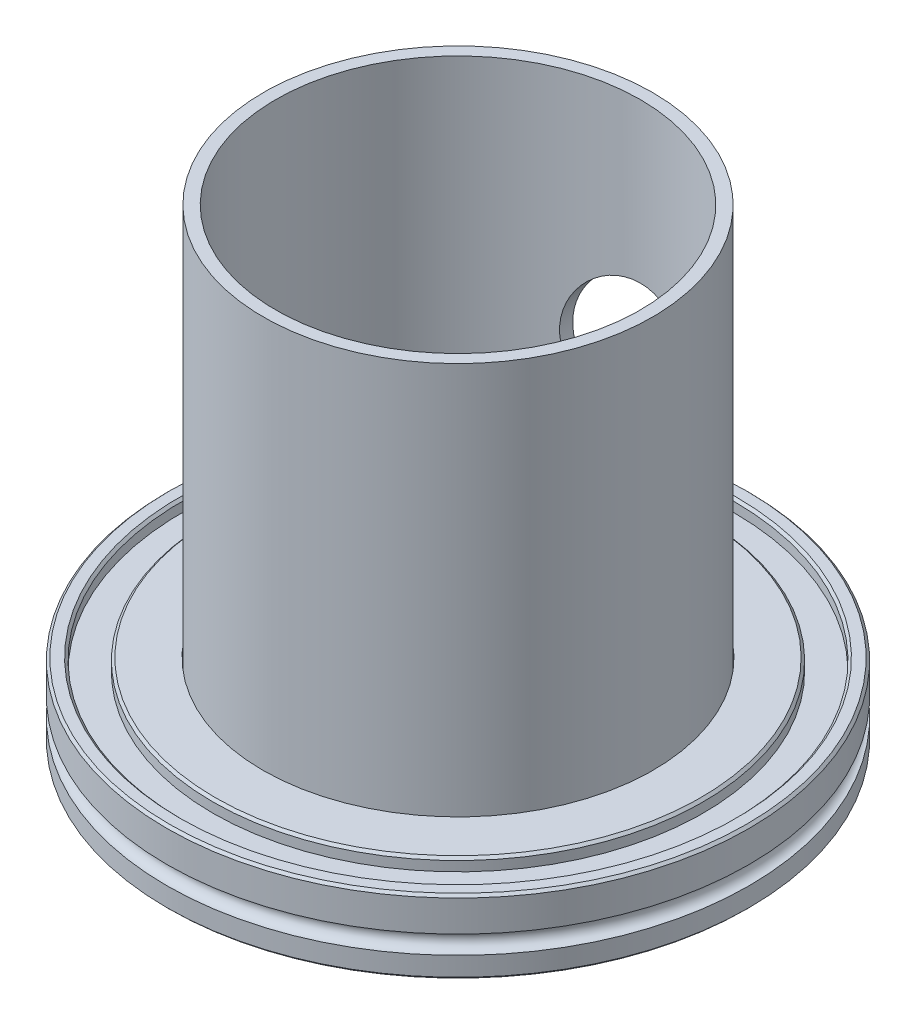
ISO-10303-21;
HEADER;
FILE_DESCRIPTION(('STEP AP214'),'2;1');
FILE_NAME('part.step','',(''),(''),'','','');
FILE_SCHEMA(('AUTOMOTIVE_DESIGN { 1 0 10303 214 1 1 1 1 }'));
ENDSEC;
DATA;
#1=APPLICATION_CONTEXT('core data for automotive mechanical design processes');
#2=APPLICATION_PROTOCOL_DEFINITION('international standard','automotive_design',2000,#1);
#3=PRODUCT_CONTEXT('',#1,'mechanical');
#4=PRODUCT('Part','Part','',(#3));
#5=PRODUCT_RELATED_PRODUCT_CATEGORY('part','',(#4));
#6=PRODUCT_DEFINITION_FORMATION('','',#4);
#7=PRODUCT_DEFINITION_CONTEXT('part definition',#1,'design');
#8=PRODUCT_DEFINITION('design','',#6,#7);
#9=PRODUCT_DEFINITION_SHAPE('','',#8);
#10=(LENGTH_UNIT() NAMED_UNIT(*) SI_UNIT(.MILLI.,.METRE.));
#11=(NAMED_UNIT(*) PLANE_ANGLE_UNIT() SI_UNIT($,.RADIAN.));
#12=(NAMED_UNIT(*) SI_UNIT($,.STERADIAN.) SOLID_ANGLE_UNIT());
#13=UNCERTAINTY_MEASURE_WITH_UNIT(LENGTH_MEASURE(1.E-05),#10,'distance_accuracy_value','');
#14=(GEOMETRIC_REPRESENTATION_CONTEXT(3) GLOBAL_UNCERTAINTY_ASSIGNED_CONTEXT((#13)) GLOBAL_UNIT_ASSIGNED_CONTEXT((#10,
#11,#12)) REPRESENTATION_CONTEXT('',''));
#15=CARTESIAN_POINT('',(0.,0.,0.));
#16=DIRECTION('',(0.,0.,1.));
#17=DIRECTION('',(1.,0.,0.));
#18=AXIS2_PLACEMENT_3D('',#15,#16,#17);
#19=CARTESIAN_POINT('',(0.,88.,0.));
#20=DIRECTION('',(0.,-1.,0.));
#21=DIRECTION('',(0.,0.,-1.));
#22=AXIS2_PLACEMENT_3D('',#19,#20,#21);
#23=CYLINDRICAL_SURFACE('',#22,31.75);
#24=CARTESIAN_POINT('',(0.,50.05,-31.75));
#25=CARTESIAN_POINT('',(0.300690895080465,50.0500005156842,-31.75000035982));
#26=CARTESIAN_POINT('',(0.601374131881649,50.0377167906727,-31.745718842423));
#27=CARTESIAN_POINT('',(1.2004918463426,49.9887055015852,-31.7287112770903));
#28=CARTESIAN_POINT('',(1.49892640003173,49.9519787677269,-31.7159855159672));
#29=CARTESIAN_POINT('',(2.09136308876352,49.8544382096093,-31.6824357689113));
#30=CARTESIAN_POINT('',(2.3853652353364,49.7936244480199,-31.6616118040485));
#31=CARTESIAN_POINT('',(2.96685715253441,49.6484770234051,-31.6124248580072));
#32=CARTESIAN_POINT('',(3.25434683525223,49.5641430431006,-31.584061775129));
#33=CARTESIAN_POINT('',(3.82029293830336,49.3728928600984,-31.5206089898371));
#34=CARTESIAN_POINT('',(4.09876624671155,49.2660220763597,-31.4855328293977));
#35=CARTESIAN_POINT('',(4.64559610276489,49.030433947205,-31.4095077312112));
#36=CARTESIAN_POINT('',(4.91394885833678,48.9017085105268,-31.3685566192506));
#37=CARTESIAN_POINT('',(5.43878865303357,48.6234246778562,-31.2818290624013));
#38=CARTESIAN_POINT('',(5.69527612401064,48.4738670408742,-31.2360527933295));
#39=CARTESIAN_POINT('',(6.19492495640996,48.1549578890103,-31.1408108523512));
#40=CARTESIAN_POINT('',(6.43808547359985,47.9856051222757,-31.0913449471822));
#41=CARTESIAN_POINT('',(6.91764986517101,47.6221895322685,-30.9882362345976));
#42=CARTESIAN_POINT('',(7.15355085264334,47.4274868683075,-30.9345088788247));
#43=CARTESIAN_POINT('',(7.60825998516378,47.019365134097,-30.8258258093097));
#44=CARTESIAN_POINT('',(7.82706782556508,46.8059457304075,-30.7708700736971));
#45=CARTESIAN_POINT('',(8.24634241121008,46.3616342798133,-30.6611694771023));
#46=CARTESIAN_POINT('',(8.44680448175616,46.1307378067978,-30.606424673253));
#47=CARTESIAN_POINT('',(8.82807846389534,45.6528908596319,-30.4986358309338));
#48=CARTESIAN_POINT('',(9.00889086894288,45.4059407888782,-30.4455917497779));
#49=CARTESIAN_POINT('',(9.3551665729816,44.8892408147034,-30.3410139114411));
#50=CARTESIAN_POINT('',(9.51994912473718,44.6190130519378,-30.2895836083697));
#51=CARTESIAN_POINT('',(9.82599451735102,44.0648282336426,-30.1916900604356));
#52=CARTESIAN_POINT('',(9.96726669321161,43.7808766853315,-30.1452248467759));
#53=CARTESIAN_POINT('',(10.2251776357244,43.2010603008467,-30.0587218014411));
#54=CARTESIAN_POINT('',(10.3418176588083,42.9051960732295,-30.0186836419613));
#55=CARTESIAN_POINT('',(10.5493860754873,42.3036600450166,-29.946369568522));
#56=CARTESIAN_POINT('',(10.640315743721,41.9979887314623,-29.9140932697658));
#57=CARTESIAN_POINT('',(10.7927317923855,41.3903882865861,-29.8594333284922));
#58=CARTESIAN_POINT('',(10.8551662816633,41.0887253956454,-29.8367333987295));
#59=CARTESIAN_POINT('',(10.9546748120508,40.4807047363791,-29.8003425815066));
#60=CARTESIAN_POINT('',(10.9917494228402,40.174347073674,-29.7866514916737));
#61=CARTESIAN_POINT('',(11.0401378896771,39.5594180361295,-29.7687507943213));
#62=CARTESIAN_POINT('',(11.0514593678745,39.2508473434107,-29.7645383814035));
#63=CARTESIAN_POINT('',(11.0482399218699,38.6338647415682,-29.7657336767439));
#64=CARTESIAN_POINT('',(11.0336998156538,38.325452827731,-29.7711410807332));
#65=CARTESIAN_POINT('',(10.9803038392177,37.7267576883486,-29.7908740572713));
#66=CARTESIAN_POINT('',(10.9427125578034,37.4363452703355,-29.8047356329137));
#67=CARTESIAN_POINT('',(10.8447218804256,36.8599132969832,-29.8405299009376));
#68=CARTESIAN_POINT('',(10.7843233662948,36.5738935722471,-29.8624622812638));
#69=CARTESIAN_POINT('',(10.6412602502499,36.0081394019979,-29.9137400628851));
#70=CARTESIAN_POINT('',(10.5585936414715,35.7284055254462,-29.9430861323084));
#71=CARTESIAN_POINT('',(10.3716975542914,35.1770253924354,-30.0083351224241));
#72=CARTESIAN_POINT('',(10.2674674579663,34.905379367997,-30.0442382310116));
#73=CARTESIAN_POINT('',(10.0363226478664,34.3672996512433,-30.1222483808828));
#74=CARTESIAN_POINT('',(9.90905419236389,34.1010317379861,-30.1644500510245));
#75=CARTESIAN_POINT('',(9.63395775032871,33.5800204365901,-30.2534337600581));
#76=CARTESIAN_POINT('',(9.48612220175092,33.3252813331942,-30.3002174817831));
#77=CARTESIAN_POINT('',(9.17091575934698,32.8288360690796,-30.3971048194745));
#78=CARTESIAN_POINT('',(9.00354347835383,32.5871308355885,-30.4472086710707));
#79=CARTESIAN_POINT('',(8.65031158429654,32.1180806581013,-30.549442068398));
#80=CARTESIAN_POINT('',(8.46445125542425,31.8907362706765,-30.6015716925141));
#81=CARTESIAN_POINT('',(8.06412225648807,31.4390032769357,-30.709572405034));
#82=CARTESIAN_POINT('',(7.84862287944203,31.2155372038205,-30.7654862029118));
#83=CARTESIAN_POINT('',(7.39959006710579,30.7875255283746,-30.8765611507735));
#84=CARTESIAN_POINT('',(7.16606411357332,30.5829721531599,-30.9317226019449));
#85=CARTESIAN_POINT('',(6.68217944936824,30.1938994943586,-31.0398527389196));
#86=CARTESIAN_POINT('',(6.43181158527929,30.0093912498976,-31.0928202066318));
#87=CARTESIAN_POINT('',(5.91599457715377,29.661896766102,-31.1950733441729));
#88=CARTESIAN_POINT('',(5.65055157595089,29.498901849221,-31.2443604949774));
#89=CARTESIAN_POINT('',(5.1029113185686,29.1937666563206,-31.3384889627525));
#90=CARTESIAN_POINT('',(4.82055190792846,29.0518985058445,-31.3832701962722));
#91=CARTESIAN_POINT('',(4.24391548163812,28.7925704680729,-31.4664349020288));
#92=CARTESIAN_POINT('',(3.94963829222402,28.6751109368138,-31.5048182809417));
#93=CARTESIAN_POINT('',(3.35137374148965,28.4657130653887,-31.5740626811614));
#94=CARTESIAN_POINT('',(3.04738940333412,28.3737668642211,-31.6049260191364));
#95=CARTESIAN_POINT('',(2.43193960289168,28.216259907329,-31.6582303488815));
#96=CARTESIAN_POINT('',(2.12047452036742,28.1506978151933,-31.6806717672361));
#97=CARTESIAN_POINT('',(1.50723824520651,28.0490746424171,-31.7156208292412));
#98=CARTESIAN_POINT('',(1.20569517611836,28.0117769744164,-31.7285440661406));
#99=CARTESIAN_POINT('',(0.600319048650861,27.9621404728355,-31.7457681603091));
#100=CARTESIAN_POINT('',(0.296486062055467,27.9498008601137,-31.7500692867435));
#101=CARTESIAN_POINT('',(-0.311109145623252,27.9502039777405,-31.7499290295277));
#102=CARTESIAN_POINT('',(-0.614871370102856,27.9629425629061,-31.7454890906908));
#103=CARTESIAN_POINT('',(-1.22006440706742,28.0133654056989,-31.7279936457541));
#104=CARTESIAN_POINT('',(-1.52149524683133,28.0510493709983,-31.7149382406166));
#105=CARTESIAN_POINT('',(-2.11013697820626,28.1493785697424,-31.6811289797152));
#106=CARTESIAN_POINT('',(-2.39749334150373,28.2092459897014,-31.660636344721));
#107=CARTESIAN_POINT('',(-2.96595894076156,28.3514587883021,-31.6124493996606));
#108=CARTESIAN_POINT('',(-3.24706834647983,28.4338035553235,-31.5847552855514));
#109=CARTESIAN_POINT('',(-3.80119699243916,28.6202671094532,-31.5228667244049));
#110=CARTESIAN_POINT('',(-4.07421695250037,28.7243839525417,-31.4886728577527));
#111=CARTESIAN_POINT('',(-4.61061187667333,28.9536144672915,-31.4146159928953));
#112=CARTESIAN_POINT('',(-4.87398314131345,29.0787360919896,-31.3747508482507));
#113=CARTESIAN_POINT('',(-5.39643670433907,29.3527039554777,-31.2891823720582));
#114=CARTESIAN_POINT('',(-5.65520839948603,29.5021021066272,-31.2433499150973));
#115=CARTESIAN_POINT('',(-6.15940172508181,29.8210408874604,-31.1478753303135));
#116=CARTESIAN_POINT('',(-6.40481871505493,29.9905884542985,-31.0982318925195));
#117=CARTESIAN_POINT('',(-6.88084536223113,30.3486887397517,-30.9963824475199));
#118=CARTESIAN_POINT('',(-7.11145335245621,30.5372435918082,-30.9441761529888));
#119=CARTESIAN_POINT('',(-7.55655031345717,30.9321887090097,-30.8385048220114));
#120=CARTESIAN_POINT('',(-7.77103870620425,31.1385796131634,-30.7850397405168));
#121=CARTESIAN_POINT('',(-8.19297979483661,31.578739546238,-30.6755185608546));
#122=CARTESIAN_POINT('',(-8.39954496994829,31.8133613893059,-30.6194665276445));
#123=CARTESIAN_POINT('',(-8.79216933371628,32.2994157310088,-30.5090453085039));
#124=CARTESIAN_POINT('',(-8.97823523244062,32.5508426852375,-30.4546755761186));
#125=CARTESIAN_POINT('',(-9.3287453822852,33.0691548597222,-30.3491438827809));
#126=CARTESIAN_POINT('',(-9.49318001920957,33.3360468781517,-30.2979833534352));
#127=CARTESIAN_POINT('',(-9.79903818803356,33.8834004150009,-30.200448995231));
#128=CARTESIAN_POINT('',(-9.94047135142472,34.1638561896633,-30.154073165847));
#129=CARTESIAN_POINT('',(-10.1992523282185,34.7366092009495,-30.067530350733));
#130=CARTESIAN_POINT('',(-10.316599709802,35.0289066497629,-30.0273634763227));
#131=CARTESIAN_POINT('',(-10.5261452482849,35.6233057504148,-29.9545503195505));
#132=CARTESIAN_POINT('',(-10.6183432787904,35.9254074515184,-29.9219040749853));
#133=CARTESIAN_POINT('',(-10.7766440924319,36.5370375459517,-29.865256046364));
#134=CARTESIAN_POINT('',(-10.8427579125745,36.8465627392434,-29.8412506065037));
#135=CARTESIAN_POINT('',(-10.9482393305961,37.4707155566526,-29.8027133727632));
#136=CARTESIAN_POINT('',(-10.9876084445581,37.7853428905085,-29.7881810418807));
#137=CARTESIAN_POINT('',(-11.0377251883235,38.3994461887445,-29.7696453308793));
#138=CARTESIAN_POINT('',(-11.0499495095804,38.6987861529297,-29.7650988771949));
#139=CARTESIAN_POINT('',(-11.0500501723302,39.2974641530449,-29.7650616640377));
#140=CARTESIAN_POINT('',(-11.0379274636723,39.5968021885946,-29.7695705512893));
#141=CARTESIAN_POINT('',(-10.9894609104999,40.1932149658218,-29.7874958759133));
#142=CARTESIAN_POINT('',(-10.95311879319,40.4902898673666,-29.8009116780897));
#143=CARTESIAN_POINT('',(-10.8565779411984,41.0800222133951,-29.836217095534));
#144=CARTESIAN_POINT('',(-10.7963791556491,41.3726796484586,-29.8581067288699));
#145=CARTESIAN_POINT('',(-10.6543435085894,41.9448896489602,-29.9090790916427));
#146=CARTESIAN_POINT('',(-10.5730327174273,42.2245888553043,-29.9379859594928));
#147=CARTESIAN_POINT('',(-10.3888412800105,42.7761138614234,-30.0023997460064));
#148=CARTESIAN_POINT('',(-10.285953010309,43.0479368397467,-30.0379089968256));
#149=CARTESIAN_POINT('',(-10.0594354377529,43.5819628641741,-30.1145237809768));
#150=CARTESIAN_POINT('',(-9.93580670844167,43.84416617605,-30.1556291595512));
#151=CARTESIAN_POINT('',(-9.66868821529002,44.3574895124538,-30.2423325510385));
#152=CARTESIAN_POINT('',(-9.52519702096177,44.6086087369901,-30.2879308874643));
#153=CARTESIAN_POINT('',(-9.21213977665864,45.109854981626,-30.384651594282));
#154=CARTESIAN_POINT('',(-9.04166789822987,45.3593859321568,-30.4359325988209));
#155=CARTESIAN_POINT('',(-8.68112564694108,45.8433633631837,-30.5407234996947));
#156=CARTESIAN_POINT('',(-8.4910547827271,46.0778094652574,-30.5942334518901));
#157=CARTESIAN_POINT('',(-8.09243057167531,46.5303394080973,-30.7020797610492));
#158=CARTESIAN_POINT('',(-7.88387209122085,46.7484186729032,-30.7564163440592));
#159=CARTESIAN_POINT('',(-7.44954816709204,47.1668640195882,-30.8644910103958));
#160=CARTESIAN_POINT('',(-7.22378289327459,47.3672302762791,-30.9182290996246));
#161=CARTESIAN_POINT('',(-6.7459883896643,47.7574789961695,-31.0260652381019));
#162=CARTESIAN_POINT('',(-6.49323919686178,47.9465059149967,-31.0800741010166));
#163=CARTESIAN_POINT('',(-5.97207224954115,48.302494346894,-31.184410242504));
#164=CARTESIAN_POINT('',(-5.70366037937476,48.4694640707166,-31.2347388878988));
#165=CARTESIAN_POINT('',(-5.15278847842807,48.7801467877741,-31.3303273890735));
#166=CARTESIAN_POINT('',(-4.8703269915518,48.9238573638483,-31.3755867178844));
#167=CARTESIAN_POINT('',(-4.2933082162826,49.1867813574425,-31.4597360693755));
#168=CARTESIAN_POINT('',(-3.99875128541971,49.3059954984296,-31.4986262801516));
#169=CARTESIAN_POINT('',(-3.40412098702529,49.5172488357929,-31.5683817549611));
#170=CARTESIAN_POINT('',(-3.10419514377417,49.6096663643348,-31.5993579253587));
#171=CARTESIAN_POINT('',(-2.49687101847958,49.7687820790432,-31.6531365538825));
#172=CARTESIAN_POINT('',(-2.18947278081093,49.8354804179036,-31.6759390605352));
#173=CARTESIAN_POINT('',(-1.56967785006184,49.9424622431696,-31.7126938842791));
#174=CARTESIAN_POINT('',(-1.25728261582248,49.9827532998649,-31.7266487377278));
#175=CARTESIAN_POINT('',(-0.62992205571867,50.0365214050032,-31.7453014334221));
#176=CARTESIAN_POINT('',(-0.314956826762412,50.0499994598498,-31.7499996231087));
#177=CARTESIAN_POINT('',(0.,50.05,-31.75));
#178=B_SPLINE_CURVE_WITH_KNOTS('',3,(#24,#25,#26,#27,#28,#29,#30,#31,#32,#33,#34,#35,#36,#37,
#38,#39,#40,#41,#42,#43,#44,#45,#46,#47,#48,#49,#50,#51,#52,#53,#54,#55,#56,#57,#58,#59,#60,#61,
#62,#63,#64,#65,#66,#67,#68,#69,#70,#71,#72,#73,#74,#75,#76,#77,#78,#79,#80,#81,#82,#83,#84,#85,
#86,#87,#88,#89,#90,#91,#92,#93,#94,#95,#96,#97,#98,#99,#100,#101,#102,#103,#104,#105,#106,#107,
#108,#109,#110,#111,#112,#113,#114,#115,#116,#117,#118,#119,#120,#121,#122,#123,#124,#125,#126,
#127,#128,#129,#130,#131,#132,#133,#134,#135,#136,#137,#138,#139,#140,#141,#142,#143,#144,#145,
#146,#147,#148,#149,#150,#151,#152,#153,#154,#155,#156,#157,#158,#159,#160,#161,#162,#163,#164,
#165,#166,#167,#168,#169,#170,#171,#172,#173,#174,#175,#176,#177),.UNSPECIFIED.,.T.,.F.,(4,2,2,
2,2,2,2,2,2,2,2,2,2,2,2,2,2,2,2,2,2,2,2,2,2,2,2,2,2,2,2,2,2,2,2,2,2,2,2,2,2,2,2,2,2,2,2,2,2,2,2,
2,2,2,2,2,2,2,2,2,2,2,2,2,2,2,2,2,2,2,2,2,2,2,2,2,4),(0.,0.901779532946565,1.80352843811183,
2.70527499711432,3.60703372093544,4.50699218593701,5.40728457263657,6.30754416622315,
7.20786072345675,8.13848032097807,9.06911650091346,9.99998916042524,10.9308384378878,
11.8916276900489,12.8520345374237,13.8123923847287,14.7727026121586,15.6981899552227,
16.623656507628,17.548849114212,18.4740124580498,19.3524707755349,20.2308951312491,
21.1093986795763,21.9879274057867,22.8813097254924,23.7750213936539,24.6687965566866,
25.5626063378005,26.5078383829513,27.4526802063895,28.3980397572187,29.3430168179042,
30.2992724746183,31.2555420787791,32.211516715367,33.1674429237118,34.07865073822,
34.9898301061693,35.9008588776497,36.811876973232,37.6935822330398,38.5752635035811,
39.4568660827449,40.3388032189258,41.2446859407986,42.1508814535601,43.0571787942385,
43.9635086181249,44.9151394977112,45.8664579467685,46.8181977989283,47.7695380937092,
48.7208954429932,49.6722575734505,50.6232167214029,51.5741219576274,52.4718805625695,
53.3696041439879,54.2672637111881,55.1649251923988,56.0420674101851,56.9195200510051,
57.7969484313108,58.6744400366129,59.5929847437174,60.5115524846856,61.4303760961338,
62.3491906385875,63.3086401495289,64.267731494561,65.2269224473474,66.1860850677258,
67.1309605411645,68.0758304048276,69.020429279948,69.9649926996689),.UNSPECIFIED.);
#179=CARTESIAN_POINT('',(0.,50.05,-31.75));
#180=VERTEX_POINT('',#179);
#181=EDGE_CURVE('E69',#180,#180,#178,.T.);
#182=ORIENTED_EDGE('',*,*,#181,.F.);
#183=EDGE_LOOP('',(#182));
#184=FACE_BOUND('',#183,.T.);
#185=CARTESIAN_POINT('',(0.,76.,0.));
#186=DIRECTION('',(0.,-1.,0.));
#187=DIRECTION('',(0.,0.,-1.));
#188=AXIS2_PLACEMENT_3D('',#185,#186,#187);
#189=CIRCLE('',#188,31.75);
#190=CARTESIAN_POINT('',(0.,76.,-31.75));
#191=VERTEX_POINT('',#190);
#192=EDGE_CURVE('E11',#191,#191,#189,.T.);
#193=ORIENTED_EDGE('',*,*,#192,.T.);
#194=EDGE_LOOP('',(#193));
#195=FACE_BOUND('',#194,.T.);
#196=CARTESIAN_POINT('',(0.,6.50000000000001,0.));
#197=DIRECTION('',(0.,-1.,0.));
#198=DIRECTION('',(0.,0.,-1.));
#199=AXIS2_PLACEMENT_3D('',#196,#197,#198);
#200=CIRCLE('',#199,31.75);
#201=CARTESIAN_POINT('',(0.,6.50000000000001,-31.75));
#202=VERTEX_POINT('',#201);
#203=EDGE_CURVE('E66',#202,#202,#200,.T.);
#204=ORIENTED_EDGE('',*,*,#203,.F.);
#205=EDGE_LOOP('',(#204));
#206=FACE_BOUND('',#205,.T.);
#207=ADVANCED_FACE('F44',(#184,#195,#206),#23,.T.);
#208=CARTESIAN_POINT('',(31.75,76.,0.));
#209=DIRECTION('',(0.,1.,0.));
#210=DIRECTION('',(0.,0.,1.));
#211=AXIS2_PLACEMENT_3D('',#208,#209,#210);
#212=PLANE('',#211);
#213=CARTESIAN_POINT('',(0.,76.,0.));
#214=DIRECTION('',(0.,-1.,0.));
#215=DIRECTION('',(0.,0.,-1.));
#216=AXIS2_PLACEMENT_3D('',#213,#214,#215);
#217=CIRCLE('',#216,29.75);
#218=CARTESIAN_POINT('',(0.,76.,-29.75));
#219=VERTEX_POINT('',#218);
#220=EDGE_CURVE('E57',#219,#219,#217,.T.);
#221=ORIENTED_EDGE('',*,*,#220,.T.);
#222=EDGE_LOOP('',(#221));
#223=FACE_BOUND('',#222,.T.);
#224=ORIENTED_EDGE('',*,*,#192,.F.);
#225=EDGE_LOOP('',(#224));
#226=FACE_BOUND('',#225,.T.);
#227=ADVANCED_FACE('F86',(#223,#226),#212,.T.);
#228=CARTESIAN_POINT('',(0.,88.,0.));
#229=DIRECTION('',(0.,-1.,0.));
#230=DIRECTION('',(0.,0.,-1.));
#231=AXIS2_PLACEMENT_3D('',#228,#229,#230);
#232=CYLINDRICAL_SURFACE('',#231,29.75);
#233=CARTESIAN_POINT('',(0.,50.05,-29.75));
#234=CARTESIAN_POINT('',(-0.299403647460229,50.0500012648861,-29.7500009228947));
#235=CARTESIAN_POINT('',(-0.598789652454174,50.0378220350328,-29.7454704340654));
#236=CARTESIAN_POINT('',(-1.19530106376984,49.9892349291685,-29.7274749991734));
#237=CARTESIAN_POINT('',(-1.49242664422633,49.9528289390116,-29.7140107485308));
#238=CARTESIAN_POINT('',(-2.08220322779437,49.8561605213009,-29.6785142128897));
#239=CARTESIAN_POINT('',(-2.37485480413971,49.7959011770311,-29.6564830352584));
#240=CARTESIAN_POINT('',(-2.95365642006937,49.6521049805043,-29.6044397396535));
#241=CARTESIAN_POINT('',(-3.23980629856762,49.5685675521882,-29.5744274241726));
#242=CARTESIAN_POINT('',(-3.80305782217919,49.3791785166124,-29.5072792649637));
#243=CARTESIAN_POINT('',(-4.08017761682961,49.2733753248319,-29.4701588927761));
#244=CARTESIAN_POINT('',(-4.62435974734325,49.0401922912059,-29.3896833538278));
#245=CARTESIAN_POINT('',(-4.89141830864754,48.9128044483061,-29.3463258759841));
#246=CARTESIAN_POINT('',(-5.41377745238345,48.6374625660295,-29.2544671252917));
#247=CARTESIAN_POINT('',(-5.66907810101695,48.4895086424671,-29.2059658814098));
#248=CARTESIAN_POINT('',(-6.16650000961322,48.1740679383625,-29.1050029905929));
#249=CARTESIAN_POINT('',(-6.40862036702187,48.0065798226284,-29.0525410730264));
#250=CARTESIAN_POINT('',(-6.88720780276113,47.6464957056734,-28.9428987112271));
#251=CARTESIAN_POINT('',(-7.12311877722643,47.453191786225,-28.8856149789072));
#252=CARTESIAN_POINT('',(-7.57797912924046,47.0479512149347,-28.7696338744795));
#253=CARTESIAN_POINT('',(-7.79692817421006,46.8360141979203,-28.7109364746829));
#254=CARTESIAN_POINT('',(-8.21666519489252,46.3947056609022,-28.5936429884038));
#255=CARTESIAN_POINT('',(-8.41744767406728,46.1653289026464,-28.5350469378109));
#256=CARTESIAN_POINT('',(-8.7995619013065,45.6905211716524,-28.4195365589262));
#257=CARTESIAN_POINT('',(-8.98089411706396,45.4450905851664,-28.3626221902211));
#258=CARTESIAN_POINT('',(-9.32937113544108,44.9300585884289,-28.2499579733429));
#259=CARTESIAN_POINT('',(-9.49572743755744,44.6598956040966,-28.1943321188));
#260=CARTESIAN_POINT('',(-9.80490718269307,44.1055817784741,-28.0883073294252));
#261=CARTESIAN_POINT('',(-9.9477400517837,43.8214365995579,-28.0379063039675));
#262=CARTESIAN_POINT('',(-10.20872353693,43.2409568811328,-27.9439387495343));
#263=CARTESIAN_POINT('',(-10.3268763564818,42.9446234326529,-27.9003716104991));
#264=CARTESIAN_POINT('',(-10.5373806581126,42.3418557741294,-27.8215520751827));
#265=CARTESIAN_POINT('',(-10.6297336212646,42.0354221450289,-27.7862992016289));
#266=CARTESIAN_POINT('',(-10.7844790313012,41.4273302104678,-27.7265957673938));
#267=CARTESIAN_POINT('',(-10.8479304900007,41.1259785462947,-27.7017665643096));
#268=CARTESIAN_POINT('',(-10.9495122886665,40.5183990838824,-27.6617727762788));
#269=CARTESIAN_POINT('',(-10.9876432678788,40.2121714089438,-27.6466079473439));
#270=CARTESIAN_POINT('',(-11.0381497228739,39.5973708367286,-27.6264817358469));
#271=CARTESIAN_POINT('',(-11.0505341379775,39.288798790788,-27.6215168118398));
#272=CARTESIAN_POINT('',(-11.049430585873,38.6717144360759,-27.6219584519606));
#273=CARTESIAN_POINT('',(-11.0359435957694,38.3632021254885,-27.6273646243956));
#274=CARTESIAN_POINT('',(-10.984803643523,37.766766920574,-27.6477355247504));
#275=CARTESIAN_POINT('',(-10.9486137637914,37.4786972941756,-27.6621213023311));
#276=CARTESIAN_POINT('',(-10.8538112596583,36.9068507283789,-27.6994561959728));
#277=CARTESIAN_POINT('',(-10.7951996432336,36.623073596606,-27.7224049270822));
#278=CARTESIAN_POINT('',(-10.6560963629364,36.0616747952473,-27.7761707271948));
#279=CARTESIAN_POINT('',(-10.5756024347167,35.7840537659027,-27.8069886104656));
#280=CARTESIAN_POINT('',(-10.3934372741569,35.2367361292109,-27.8755883206495));
#281=CARTESIAN_POINT('',(-10.2917653618028,34.9670397766383,-27.9133703711739));
#282=CARTESIAN_POINT('',(-10.0659887239263,34.4322697363085,-27.99559002956));
#283=CARTESIAN_POINT('',(-9.94150451149749,34.1673733065941,-28.0401376307408));
#284=CARTESIAN_POINT('',(-9.67229363000387,33.6488689154233,-28.1341351501864));
#285=CARTESIAN_POINT('',(-9.52755953815861,33.3952651385342,-28.1835868641546));
#286=CARTESIAN_POINT('',(-9.21884485332218,32.9007901250827,-28.2860715587753));
#287=CARTESIAN_POINT('',(-9.0548624289019,32.6599201032717,-28.3391048800044));
#288=CARTESIAN_POINT('',(-8.70866501555802,32.1921868057935,-28.4473996147686));
#289=CARTESIAN_POINT('',(-8.52644921847063,31.9653241517007,-28.5026611269998));
#290=CARTESIAN_POINT('',(-8.13219049215716,31.5122762008826,-28.6177371037488));
#291=CARTESIAN_POINT('',(-7.91897198638232,31.2871276487864,-28.677611000961));
#292=CARTESIAN_POINT('',(-7.47437563960793,30.8555444275745,-28.7966862881852));
#293=CARTESIAN_POINT('',(-7.24300519701264,30.6491022072691,-28.8558879410446));
#294=CARTESIAN_POINT('',(-6.76325230307458,30.2560228043459,-28.9720875625812));
#295=CARTESIAN_POINT('',(-6.51486004738336,30.0693971963136,-29.029084231141));
#296=CARTESIAN_POINT('',(-6.00276747432825,29.717448182774,-29.1392834720041));
#297=CARTESIAN_POINT('',(-5.73907341635669,29.5521161547322,-29.1924875761312));
#298=CARTESIAN_POINT('',(-5.19378936418314,29.2415689056537,-29.2944556538879));
#299=CARTESIAN_POINT('',(-4.91198832480893,29.0966975332484,-29.3431398754085));
#300=CARTESIAN_POINT('',(-4.33606554212287,28.8313444238953,-29.4337560929407));
#301=CARTESIAN_POINT('',(-4.04194357939189,28.7108631215251,-29.4756879686377));
#302=CARTESIAN_POINT('',(-3.44359129488311,28.4954655413301,-29.5515664805557));
#303=CARTESIAN_POINT('',(-3.13936457771194,28.4005402547917,-29.5855159301142));
#304=CARTESIAN_POINT('',(-2.52303374463049,28.2371741642824,-29.6444363342819));
#305=CARTESIAN_POINT('',(-2.21093009131545,28.1687318088642,-29.6694078148406));
#306=CARTESIAN_POINT('',(-1.59784196210475,28.0619426633768,-29.7085639080173));
#307=CARTESIAN_POINT('',(-1.29713023220899,28.0222084619433,-29.7232445916274));
#308=CARTESIAN_POINT('',(-0.693154678308207,27.9675946744285,-29.7434584107762));
#309=CARTESIAN_POINT('',(-0.389890943751787,27.952714220832,-29.7489918655971));
#310=CARTESIAN_POINT('',(0.216799821815422,27.9479636297105,-29.7507563646699));
#311=CARTESIAN_POINT('',(0.520226810683411,27.9580887256325,-29.7469891818077));
#312=CARTESIAN_POINT('',(1.12496375358565,28.0032328201735,-29.7302614944584));
#313=CARTESIAN_POINT('',(1.42627373870699,28.0382514524691,-29.7173011252545));
#314=CARTESIAN_POINT('',(2.01323125425971,28.1310377408509,-29.6832033400761));
#315=CARTESIAN_POINT('',(2.2990415648769,28.1878999888303,-29.6623918974813));
#316=CARTESIAN_POINT('',(2.86464818119318,28.3238169665327,-29.6131199788946));
#317=CARTESIAN_POINT('',(3.14444467690289,28.4028709939782,-29.5846597449564));
#318=CARTESIAN_POINT('',(3.69619846373802,28.5824769406899,-29.5208019439507));
#319=CARTESIAN_POINT('',(3.96815646428888,28.6830269074823,-29.4854050069676));
#320=CARTESIAN_POINT('',(4.50270311032974,28.9048556598852,-29.4085211491909));
#321=CARTESIAN_POINT('',(4.76528815342947,29.0261423138898,-29.3670319175644));
#322=CARTESIAN_POINT('',(5.28688245975267,29.292294358103,-29.2776943799818));
#323=CARTESIAN_POINT('',(5.54557107750245,29.4377380956457,-29.2296973742842));
#324=CARTESIAN_POINT('',(6.04992110158135,29.7485817449632,-29.1294883734934));
#325=CARTESIAN_POINT('',(6.29557798892804,29.9139885149906,-29.0772749319039));
#326=CARTESIAN_POINT('',(6.77245681644528,30.2636528776398,-28.96991678601));
#327=CARTESIAN_POINT('',(7.00367671884368,30.4479131217766,-28.914771669926));
#328=CARTESIAN_POINT('',(7.45040831444818,30.8341496295382,-28.802898292161));
#329=CARTESIAN_POINT('',(7.66591938487832,31.036126594843,-28.7461699678369));
#330=CARTESIAN_POINT('',(8.09190741118054,31.4686748486622,-28.6292694249813));
#331=CARTESIAN_POINT('',(8.30139302982527,31.700220575178,-28.5690856441432));
#332=CARTESIAN_POINT('',(8.70012649206748,32.1803483472354,-28.4501947261583));
#333=CARTESIAN_POINT('',(8.88938082260844,32.4289248898278,-28.3914871203375));
#334=CARTESIAN_POINT('',(9.24655648572888,32.9418321412865,-28.2771795128111));
#335=CARTESIAN_POINT('',(9.41446728159027,33.2061705374788,-28.2215810535328));
#336=CARTESIAN_POINT('',(9.72754634492434,33.748771094935,-28.1152036818758));
#337=CARTESIAN_POINT('',(9.87272417457443,34.0270273365926,-28.0644227466619));
#338=CARTESIAN_POINT('',(10.1397381347538,34.5968672002622,-27.969061463381));
#339=CARTESIAN_POINT('',(10.2614844525023,34.8884969972918,-27.924505146237));
#340=CARTESIAN_POINT('',(10.4798345798237,35.4821069060847,-27.8432963596733));
#341=CARTESIAN_POINT('',(10.5764381798469,35.7840871040889,-27.8066439561286));
#342=CARTESIAN_POINT('',(10.7434734932345,36.396001703963,-27.7425357519452));
#343=CARTESIAN_POINT('',(10.8139183997829,36.7059320116251,-27.7150753160119));
#344=CARTESIAN_POINT('',(10.9279170869658,37.3314186637813,-27.6703251942402));
#345=CARTESIAN_POINT('',(10.9714726934343,37.6469746247857,-27.6530348178394));
#346=CARTESIAN_POINT('',(11.0292993451196,38.2610329677987,-27.6300189666033));
#347=CARTESIAN_POINT('',(11.0452459898904,38.5593538937143,-27.6236321304238));
#348=CARTESIAN_POINT('',(11.0529253385169,39.1563505888441,-27.620560541262));
#349=CARTESIAN_POINT('',(11.0446591078633,39.455026341866,-27.6238753613572));
#350=CARTESIAN_POINT('',(11.0040048017099,40.0504369763085,-27.6400949973106));
#351=CARTESIAN_POINT('',(10.9716188580568,40.3471720269219,-27.6529989656213));
#352=CARTESIAN_POINT('',(10.8830686220453,40.9365202770391,-27.6879680945656));
#353=CARTESIAN_POINT('',(10.8269043355866,41.2291334775654,-27.7100332529262));
#354=CARTESIAN_POINT('',(10.6933730237864,41.7995581400927,-27.7618304979637));
#355=CARTESIAN_POINT('',(10.6166837588069,42.0775512594603,-27.7913159632611));
#356=CARTESIAN_POINT('',(10.4420917639621,42.6260278960054,-27.857385490511));
#357=CARTESIAN_POINT('',(10.3441815899866,42.8965087402846,-27.8939720429912));
#358=CARTESIAN_POINT('',(10.1279548662299,43.4282512514862,-27.9732064169085));
#359=CARTESIAN_POINT('',(10.0096387136669,43.6895130977443,-28.0158541203576));
#360=CARTESIAN_POINT('',(9.75345589376608,44.2013964428033,-28.1060675461864));
#361=CARTESIAN_POINT('',(9.61558769366364,44.452017105395,-28.1536336540605));
#362=CARTESIAN_POINT('',(9.31360322074957,44.9539439995248,-28.255016346229));
#363=CARTESIAN_POINT('',(9.14849869521568,45.2046163530499,-28.3090289116052));
#364=CARTESIAN_POINT('',(8.79876880403895,45.6913360860156,-28.4196727244403));
#365=CARTESIAN_POINT('',(8.61414290793736,45.927383067761,-28.4763040430355));
#366=CARTESIAN_POINT('',(8.22643610968267,46.3836231287876,-28.5907170668111));
#367=CARTESIAN_POINT('',(8.02334986178641,46.6038115824641,-28.6484991014085));
#368=CARTESIAN_POINT('',(7.59993423930496,47.0270231328209,-28.7637207990642));
#369=CARTESIAN_POINT('',(7.37960494497331,47.2300463093837,-28.8211604637147));
#370=CARTESIAN_POINT('',(6.910804703696,47.6280212850902,-28.9372531704756));
#371=CARTESIAN_POINT('',(6.66146118890439,47.8219752239008,-28.9958092089557));
#372=CARTESIAN_POINT('',(6.14662648061778,48.1881022402013,-29.1092928929091));
#373=CARTESIAN_POINT('',(5.88114126440405,48.3602833083303,-29.1642218659576));
#374=CARTESIAN_POINT('',(5.33553369903894,48.6816756972358,-29.2689553774629));
#375=CARTESIAN_POINT('',(5.05540726072044,48.8308805545416,-29.3187584726498));
#376=CARTESIAN_POINT('',(4.48245224122538,49.1049975580762,-29.4118062796254));
#377=CARTESIAN_POINT('',(4.18962353910669,49.2299094729423,-29.4550509289516));
#378=CARTESIAN_POINT('',(3.58276377650075,49.4582543341482,-29.5351186483193));
#379=CARTESIAN_POINT('',(3.26834909935818,49.5607694439419,-29.5716599059888));
#380=CARTESIAN_POINT('',(2.63067222246176,49.7373888671546,-29.6351939831026));
#381=CARTESIAN_POINT('',(2.30740964963026,49.8114919805787,-29.662186399243));
#382=CARTESIAN_POINT('',(1.654973450145,49.930392027175,-29.7057301919355));
#383=CARTESIAN_POINT('',(1.3258022432115,49.9752006879174,-29.7222857466248));
#384=CARTESIAN_POINT('',(0.664413242018036,50.0350024535144,-29.7444195793772));
#385=CARTESIAN_POINT('',(0.332195761672259,50.0499985965776,-29.7499989760254));
#386=CARTESIAN_POINT('',(0.,50.05,-29.75));
#387=B_SPLINE_CURVE_WITH_KNOTS('',3,(#233,#234,#235,#236,#237,#238,#239,#240,#241,#242,#243,
#244,#245,#246,#247,#248,#249,#250,#251,#252,#253,#254,#255,#256,#257,#258,#259,#260,#261,#262,
#263,#264,#265,#266,#267,#268,#269,#270,#271,#272,#273,#274,#275,#276,#277,#278,#279,#280,#281,
#282,#283,#284,#285,#286,#287,#288,#289,#290,#291,#292,#293,#294,#295,#296,#297,#298,#299,#300,
#301,#302,#303,#304,#305,#306,#307,#308,#309,#310,#311,#312,#313,#314,#315,#316,#317,#318,#319,
#320,#321,#322,#323,#324,#325,#326,#327,#328,#329,#330,#331,#332,#333,#334,#335,#336,#337,#338,
#339,#340,#341,#342,#343,#344,#345,#346,#347,#348,#349,#350,#351,#352,#353,#354,#355,#356,#357,
#358,#359,#360,#361,#362,#363,#364,#365,#366,#367,#368,#369,#370,#371,#372,#373,#374,#375,#376,
#377,#378,#379,#380,#381,#382,#383,#384,#385,#386),.UNSPECIFIED.,.T.,.F.,(4,2,2,2,2,2,2,2,2,2,2,
2,2,2,2,2,2,2,2,2,2,2,2,2,2,2,2,2,2,2,2,2,2,2,2,2,2,2,2,2,2,2,2,2,2,2,2,2,2,2,2,2,2,2,2,2,2,2,2,
2,2,2,2,2,2,2,2,2,2,2,2,2,2,2,2,2,4),(0.,0.89790001500876,1.79573014406257,2.69344425749876,
3.59118058850217,4.48698465455653,5.38312150894706,6.27925331710296,7.17544641318108,
8.10538293730135,9.03533769043497,9.96557287946182,10.8957856954218,11.8609308215071,
12.8256882584628,13.7903595226253,14.754975397245,15.6806490086665,16.6062992494518,
17.5316280466743,18.4569218970068,19.327970431642,20.1989798125957,21.0700793585612,
21.9412068793905,22.8284165370633,23.7159522658597,24.6035725099441,25.4912321137544,
26.4375880316103,27.3835602158595,28.3300819236743,29.2762191376894,30.2367329278735,
31.1972638307998,32.1574556937255,33.1175912972984,34.0274857280816,34.9373483985111,
35.8470376444789,36.7567135040996,37.6321663111576,38.5075914168999,39.3829370416319,
40.2586155504125,41.1595072535071,42.0607093415499,42.9620383475235,43.8634030672332,
44.8162732460416,45.7688369750982,46.7218691473421,47.6744993621224,48.6307112920754,
49.5869311912377,50.5426681620349,51.4983402293571,52.3936625742645,53.2889455209941,
54.1841493465718,55.0793529500395,55.9480238428708,56.8169999525139,57.6859591487736,
58.5549865039792,59.4689232953847,60.3828849277927,61.2971120732538,62.2113349639211,
63.1740050321724,64.1363207689646,65.0989067235734,66.0615018452705,67.0582028753072,
68.0549459968766,69.0512898433779,70.0475321467754),.UNSPECIFIED.);
#388=CARTESIAN_POINT('',(0.,50.05,-29.75));
#389=VERTEX_POINT('',#388);
#390=EDGE_CURVE('E48',#389,#389,#387,.T.);
#391=ORIENTED_EDGE('',*,*,#390,.F.);
#392=EDGE_LOOP('',(#391));
#393=FACE_BOUND('',#392,.T.);
#394=CARTESIAN_POINT('',(0.,6.50000000000001,0.));
#395=DIRECTION('',(0.,-1.,0.));
#396=DIRECTION('',(0.,0.,-1.));
#397=AXIS2_PLACEMENT_3D('',#394,#395,#396);
#398=CIRCLE('',#397,29.75);
#399=CARTESIAN_POINT('',(0.,6.50000000000001,-29.75));
#400=VERTEX_POINT('',#399);
#401=EDGE_CURVE('E61',#400,#400,#398,.T.);
#402=ORIENTED_EDGE('',*,*,#401,.T.);
#403=EDGE_LOOP('',(#402));
#404=FACE_BOUND('',#403,.T.);
#405=ORIENTED_EDGE('',*,*,#220,.F.);
#406=EDGE_LOOP('',(#405));
#407=FACE_BOUND('',#406,.T.);
#408=ADVANCED_FACE('F82',(#393,#404,#407),#232,.F.);
#409=CARTESIAN_POINT('',(29.75,6.5,0.));
#410=DIRECTION('',(0.,-1.,0.));
#411=DIRECTION('',(0.,0.,-1.));
#412=AXIS2_PLACEMENT_3D('',#409,#410,#411);
#413=PLANE('',#412);
#414=ORIENTED_EDGE('',*,*,#203,.T.);
#415=EDGE_LOOP('',(#414));
#416=FACE_BOUND('',#415,.T.);
#417=ORIENTED_EDGE('',*,*,#401,.F.);
#418=EDGE_LOOP('',(#417));
#419=FACE_BOUND('',#418,.T.);
#420=ADVANCED_FACE('F78',(#416,#419),#413,.T.);
#421=CARTESIAN_POINT('',(0.,39.,-47.5));
#422=DIRECTION('',(0.,0.,1.));
#423=DIRECTION('',(1.,0.,0.));
#424=AXIS2_PLACEMENT_3D('',#421,#422,#423);
#425=CYLINDRICAL_SURFACE('',#424,11.05);
#426=ORIENTED_EDGE('',*,*,#181,.T.);
#427=EDGE_LOOP('',(#426));
#428=FACE_BOUND('',#427,.T.);
#429=ORIENTED_EDGE('',*,*,#390,.T.);
#430=EDGE_LOOP('',(#429));
#431=FACE_BOUND('',#430,.T.);
#432=ADVANCED_FACE('F74',(#428,#431),#425,.F.);
#433=CLOSED_SHELL('',(#207,#227,#408,#420,#432));
#434=MANIFOLD_SOLID_BREP('B2',#433);
#435=CARTESIAN_POINT('',(0.,5.,0.));
#436=DIRECTION('',(0.,1.,0.));
#437=DIRECTION('',(0.,0.,1.));
#438=AXIS2_PLACEMENT_3D('',#435,#436,#437);
#439=TOROIDAL_SURFACE('',#438,47.5,1.5);
#440=CARTESIAN_POINT('',(0.,3.5,0.));
#441=DIRECTION('',(0.,1.,0.));
#442=DIRECTION('',(0.,0.,1.));
#443=AXIS2_PLACEMENT_3D('',#440,#441,#442);
#444=CIRCLE('',#443,47.5);
#445=CARTESIAN_POINT('',(0.,3.5,47.5));
#446=VERTEX_POINT('',#445);
#447=EDGE_CURVE('E197',#446,#446,#444,.T.);
#448=ORIENTED_EDGE('',*,*,#447,.T.);
#449=EDGE_LOOP('',(#448));
#450=FACE_BOUND('',#449,.T.);
#451=CARTESIAN_POINT('',(0.,6.5,0.));
#452=DIRECTION('',(0.,1.,0.));
#453=DIRECTION('',(0.,0.,1.));
#454=AXIS2_PLACEMENT_3D('',#451,#452,#453);
#455=CIRCLE('',#454,47.5);
#456=CARTESIAN_POINT('',(0.,6.5,47.5));
#457=VERTEX_POINT('',#456);
#458=EDGE_CURVE('E43',#457,#457,#455,.T.);
#459=ORIENTED_EDGE('',*,*,#458,.F.);
#460=EDGE_LOOP('',(#459));
#461=FACE_BOUND('',#460,.T.);
#462=ADVANCED_FACE('F136',(#450,#461),#439,.F.);
#463=CARTESIAN_POINT('',(0.,0.,0.));
#464=DIRECTION('',(0.,1.,0.));
#465=DIRECTION('',(0.,0.,1.));
#466=AXIS2_PLACEMENT_3D('',#463,#464,#465);
#467=CYLINDRICAL_SURFACE('',#466,47.5);
#468=ORIENTED_EDGE('',*,*,#458,.T.);
#469=EDGE_LOOP('',(#468));
#470=FACE_BOUND('',#469,.T.);
#471=CARTESIAN_POINT('',(0.,11.6,0.));
#472=DIRECTION('',(0.,1.,0.));
#473=DIRECTION('',(0.,0.,1.));
#474=AXIS2_PLACEMENT_3D('',#471,#472,#473);
#475=CIRCLE('',#474,47.5);
#476=CARTESIAN_POINT('',(0.,11.6,47.5));
#477=VERTEX_POINT('',#476);
#478=EDGE_CURVE('E142',#477,#477,#475,.T.);
#479=ORIENTED_EDGE('',*,*,#478,.F.);
#480=EDGE_LOOP('',(#479));
#481=FACE_BOUND('',#480,.T.);
#482=ADVANCED_FACE('F215',(#470,#481),#467,.T.);
#483=CARTESIAN_POINT('',(0.,12.,0.));
#484=DIRECTION('',(0.,-1.,0.));
#485=DIRECTION('',(0.,0.,-1.));
#486=AXIS2_PLACEMENT_3D('',#483,#484,#485);
#487=CONICAL_SURFACE('',#486,47.1,0.785398163397444);
#488=ORIENTED_EDGE('',*,*,#478,.T.);
#489=EDGE_LOOP('',(#488));
#490=FACE_BOUND('',#489,.T.);
#491=CARTESIAN_POINT('',(0.,12.,0.));
#492=DIRECTION('',(0.,1.,0.));
#493=DIRECTION('',(0.,0.,1.));
#494=AXIS2_PLACEMENT_3D('',#491,#492,#493);
#495=CIRCLE('',#494,47.1);
#496=CARTESIAN_POINT('',(0.,12.,47.1));
#497=VERTEX_POINT('',#496);
#498=EDGE_CURVE('E146',#497,#497,#495,.T.);
#499=ORIENTED_EDGE('',*,*,#498,.F.);
#500=EDGE_LOOP('',(#499));
#501=FACE_BOUND('',#500,.T.);
#502=ADVANCED_FACE('F219',(#490,#501),#487,.T.);
#503=CARTESIAN_POINT('',(45.4,12.,0.));
#504=DIRECTION('',(0.,1.,0.));
#505=DIRECTION('',(0.,0.,1.));
#506=AXIS2_PLACEMENT_3D('',#503,#504,#505);
#507=PLANE('',#506);
#508=ORIENTED_EDGE('',*,*,#498,.T.);
#509=EDGE_LOOP('',(#508));
#510=FACE_BOUND('',#509,.T.);
#511=CARTESIAN_POINT('',(0.,12.,0.));
#512=DIRECTION('',(0.,1.,0.));
#513=DIRECTION('',(0.,0.,1.));
#514=AXIS2_PLACEMENT_3D('',#511,#512,#513);
#515=CIRCLE('',#514,45.4);
#516=CARTESIAN_POINT('',(0.,12.,45.4));
#517=VERTEX_POINT('',#516);
#518=EDGE_CURVE('E150',#517,#517,#515,.T.);
#519=ORIENTED_EDGE('',*,*,#518,.F.);
#520=EDGE_LOOP('',(#519));
#521=FACE_BOUND('',#520,.T.);
#522=ADVANCED_FACE('F223',(#510,#521),#507,.T.);
#523=CARTESIAN_POINT('',(0.,11.6,0.));
#524=DIRECTION('',(0.,1.,0.));
#525=DIRECTION('',(0.,0.,1.));
#526=AXIS2_PLACEMENT_3D('',#523,#524,#525);
#527=CONICAL_SURFACE('',#526,45.,0.785398163397448);
#528=ORIENTED_EDGE('',*,*,#518,.T.);
#529=EDGE_LOOP('',(#528));
#530=FACE_BOUND('',#529,.T.);
#531=CARTESIAN_POINT('',(0.,11.6,0.));
#532=DIRECTION('',(0.,1.,0.));
#533=DIRECTION('',(0.,0.,1.));
#534=AXIS2_PLACEMENT_3D('',#531,#532,#533);
#535=CIRCLE('',#534,45.);
#536=CARTESIAN_POINT('',(0.,11.6,45.));
#537=VERTEX_POINT('',#536);
#538=EDGE_CURVE('E155',#537,#537,#535,.T.);
#539=ORIENTED_EDGE('',*,*,#538,.F.);
#540=EDGE_LOOP('',(#539));
#541=FACE_BOUND('',#540,.T.);
#542=ADVANCED_FACE('F229',(#530,#541),#527,.F.);
#543=CARTESIAN_POINT('',(0.,0.,0.));
#544=DIRECTION('',(0.,1.,0.));
#545=DIRECTION('',(0.,0.,1.));
#546=AXIS2_PLACEMENT_3D('',#543,#544,#545);
#547=CYLINDRICAL_SURFACE('',#546,45.);
#548=ORIENTED_EDGE('',*,*,#538,.T.);
#549=EDGE_LOOP('',(#548));
#550=FACE_BOUND('',#549,.T.);
#551=CARTESIAN_POINT('',(0.,10.,0.));
#552=DIRECTION('',(0.,1.,0.));
#553=DIRECTION('',(0.,0.,1.));
#554=AXIS2_PLACEMENT_3D('',#551,#552,#553);
#555=CIRCLE('',#554,45.);
#556=CARTESIAN_POINT('',(0.,10.,45.));
#557=VERTEX_POINT('',#556);
#558=EDGE_CURVE('E158',#557,#557,#555,.T.);
#559=ORIENTED_EDGE('',*,*,#558,.F.);
#560=EDGE_LOOP('',(#559));
#561=FACE_BOUND('',#560,.T.);
#562=ADVANCED_FACE('F233',(#550,#561),#547,.F.);
#563=CARTESIAN_POINT('',(40.,10.,0.));
#564=DIRECTION('',(0.,1.,0.));
#565=DIRECTION('',(0.,0.,1.));
#566=AXIS2_PLACEMENT_3D('',#563,#564,#565);
#567=PLANE('',#566);
#568=ORIENTED_EDGE('',*,*,#558,.T.);
#569=EDGE_LOOP('',(#568));
#570=FACE_BOUND('',#569,.T.);
#571=CARTESIAN_POINT('',(0.,10.,0.));
#572=DIRECTION('',(0.,1.,0.));
#573=DIRECTION('',(0.,0.,1.));
#574=AXIS2_PLACEMENT_3D('',#571,#572,#573);
#575=CIRCLE('',#574,40.);
#576=CARTESIAN_POINT('',(0.,10.,40.));
#577=VERTEX_POINT('',#576);
#578=EDGE_CURVE('E161',#577,#577,#575,.T.);
#579=ORIENTED_EDGE('',*,*,#578,.F.);
#580=EDGE_LOOP('',(#579));
#581=FACE_BOUND('',#580,.T.);
#582=ADVANCED_FACE('F237',(#570,#581),#567,.T.);
#583=CARTESIAN_POINT('',(0.,0.,0.));
#584=DIRECTION('',(0.,1.,0.));
#585=DIRECTION('',(0.,0.,1.));
#586=AXIS2_PLACEMENT_3D('',#583,#584,#585);
#587=CYLINDRICAL_SURFACE('',#586,40.);
#588=ORIENTED_EDGE('',*,*,#578,.T.);
#589=EDGE_LOOP('',(#588));
#590=FACE_BOUND('',#589,.T.);
#591=CARTESIAN_POINT('',(0.,11.6,0.));
#592=DIRECTION('',(0.,1.,0.));
#593=DIRECTION('',(0.,0.,1.));
#594=AXIS2_PLACEMENT_3D('',#591,#592,#593);
#595=CIRCLE('',#594,40.);
#596=CARTESIAN_POINT('',(0.,11.6,40.));
#597=VERTEX_POINT('',#596);
#598=EDGE_CURVE('E164',#597,#597,#595,.T.);
#599=ORIENTED_EDGE('',*,*,#598,.F.);
#600=EDGE_LOOP('',(#599));
#601=FACE_BOUND('',#600,.T.);
#602=ADVANCED_FACE('F241',(#590,#601),#587,.T.);
#603=CARTESIAN_POINT('',(0.,12.,0.));
#604=DIRECTION('',(0.,-1.,0.));
#605=DIRECTION('',(0.,0.,-1.));
#606=AXIS2_PLACEMENT_3D('',#603,#604,#605);
#607=CONICAL_SURFACE('',#606,39.6,0.785398163397409);
#608=ORIENTED_EDGE('',*,*,#598,.T.);
#609=EDGE_LOOP('',(#608));
#610=FACE_BOUND('',#609,.T.);
#611=CARTESIAN_POINT('',(0.,12.,0.));
#612=DIRECTION('',(0.,1.,0.));
#613=DIRECTION('',(0.,0.,1.));
#614=AXIS2_PLACEMENT_3D('',#611,#612,#613);
#615=CIRCLE('',#614,39.6);
#616=CARTESIAN_POINT('',(0.,12.,39.6));
#617=VERTEX_POINT('',#616);
#618=EDGE_CURVE('E167',#617,#617,#615,.T.);
#619=ORIENTED_EDGE('',*,*,#618,.F.);
#620=EDGE_LOOP('',(#619));
#621=FACE_BOUND('',#620,.T.);
#622=ADVANCED_FACE('F245',(#610,#621),#607,.T.);
#623=CARTESIAN_POINT('',(31.85,12.,0.));
#624=DIRECTION('',(0.,1.,0.));
#625=DIRECTION('',(0.,0.,1.));
#626=AXIS2_PLACEMENT_3D('',#623,#624,#625);
#627=PLANE('',#626);
#628=ORIENTED_EDGE('',*,*,#618,.T.);
#629=EDGE_LOOP('',(#628));
#630=FACE_BOUND('',#629,.T.);
#631=CARTESIAN_POINT('',(0.,12.,0.));
#632=DIRECTION('',(0.,1.,0.));
#633=DIRECTION('',(0.,0.,1.));
#634=AXIS2_PLACEMENT_3D('',#631,#632,#633);
#635=CIRCLE('',#634,31.85);
#636=CARTESIAN_POINT('',(0.,12.,31.85));
#637=VERTEX_POINT('',#636);
#638=EDGE_CURVE('E170',#637,#637,#635,.T.);
#639=ORIENTED_EDGE('',*,*,#638,.F.);
#640=EDGE_LOOP('',(#639));
#641=FACE_BOUND('',#640,.T.);
#642=ADVANCED_FACE('F249',(#630,#641),#627,.T.);
#643=CARTESIAN_POINT('',(0.,0.,0.));
#644=DIRECTION('',(0.,1.,0.));
#645=DIRECTION('',(0.,0.,1.));
#646=AXIS2_PLACEMENT_3D('',#643,#644,#645);
#647=CYLINDRICAL_SURFACE('',#646,31.85);
#648=ORIENTED_EDGE('',*,*,#638,.T.);
#649=EDGE_LOOP('',(#648));
#650=FACE_BOUND('',#649,.T.);
#651=CARTESIAN_POINT('',(0.,6.5,0.));
#652=DIRECTION('',(0.,1.,0.));
#653=DIRECTION('',(0.,0.,1.));
#654=AXIS2_PLACEMENT_3D('',#651,#652,#653);
#655=CIRCLE('',#654,31.85);
#656=CARTESIAN_POINT('',(0.,6.5,31.85));
#657=VERTEX_POINT('',#656);
#658=EDGE_CURVE('E173',#657,#657,#655,.T.);
#659=ORIENTED_EDGE('',*,*,#658,.F.);
#660=EDGE_LOOP('',(#659));
#661=FACE_BOUND('',#660,.T.);
#662=ADVANCED_FACE('F253',(#650,#661),#647,.F.);
#663=CARTESIAN_POINT('',(30.15,6.5,0.));
#664=DIRECTION('',(0.,1.,0.));
#665=DIRECTION('',(0.,0.,1.));
#666=AXIS2_PLACEMENT_3D('',#663,#664,#665);
#667=PLANE('',#666);
#668=ORIENTED_EDGE('',*,*,#658,.T.);
#669=EDGE_LOOP('',(#668));
#670=FACE_BOUND('',#669,.T.);
#671=CARTESIAN_POINT('',(0.,6.5,0.));
#672=DIRECTION('',(0.,1.,0.));
#673=DIRECTION('',(0.,0.,1.));
#674=AXIS2_PLACEMENT_3D('',#671,#672,#673);
#675=CIRCLE('',#674,30.15);
#676=CARTESIAN_POINT('',(0.,6.5,30.15));
#677=VERTEX_POINT('',#676);
#678=EDGE_CURVE('E176',#677,#677,#675,.T.);
#679=ORIENTED_EDGE('',*,*,#678,.F.);
#680=EDGE_LOOP('',(#679));
#681=FACE_BOUND('',#680,.T.);
#682=ADVANCED_FACE('F257',(#670,#681),#667,.T.);
#683=CARTESIAN_POINT('',(0.,0.,0.));
#684=DIRECTION('',(0.,1.,0.));
#685=DIRECTION('',(0.,0.,1.));
#686=AXIS2_PLACEMENT_3D('',#683,#684,#685);
#687=CYLINDRICAL_SURFACE('',#686,30.15);
#688=ORIENTED_EDGE('',*,*,#678,.T.);
#689=EDGE_LOOP('',(#688));
#690=FACE_BOUND('',#689,.T.);
#691=CARTESIAN_POINT('',(0.,4.5,0.));
#692=DIRECTION('',(0.,1.,0.));
#693=DIRECTION('',(0.,0.,1.));
#694=AXIS2_PLACEMENT_3D('',#691,#692,#693);
#695=CIRCLE('',#694,30.15);
#696=CARTESIAN_POINT('',(0.,4.5,30.15));
#697=VERTEX_POINT('',#696);
#698=EDGE_CURVE('E179',#697,#697,#695,.T.);
#699=ORIENTED_EDGE('',*,*,#698,.F.);
#700=EDGE_LOOP('',(#699));
#701=FACE_BOUND('',#700,.T.);
#702=ADVANCED_FACE('F261',(#690,#701),#687,.F.);
#703=CARTESIAN_POINT('',(35.,4.5,0.));
#704=DIRECTION('',(0.,-1.,0.));
#705=DIRECTION('',(0.,0.,-1.));
#706=AXIS2_PLACEMENT_3D('',#703,#704,#705);
#707=PLANE('',#706);
#708=ORIENTED_EDGE('',*,*,#698,.T.);
#709=EDGE_LOOP('',(#708));
#710=FACE_BOUND('',#709,.T.);
#711=CARTESIAN_POINT('',(0.,4.5,0.));
#712=DIRECTION('',(0.,1.,0.));
#713=DIRECTION('',(0.,0.,1.));
#714=AXIS2_PLACEMENT_3D('',#711,#712,#713);
#715=CIRCLE('',#714,35.);
#716=CARTESIAN_POINT('',(0.,4.5,35.));
#717=VERTEX_POINT('',#716);
#718=EDGE_CURVE('E182',#717,#717,#715,.T.);
#719=ORIENTED_EDGE('',*,*,#718,.F.);
#720=EDGE_LOOP('',(#719));
#721=FACE_BOUND('',#720,.T.);
#722=ADVANCED_FACE('F265',(#710,#721),#707,.T.);
#723=CARTESIAN_POINT('',(0.,0.,0.));
#724=DIRECTION('',(0.,1.,0.));
#725=DIRECTION('',(0.,0.,1.));
#726=AXIS2_PLACEMENT_3D('',#723,#724,#725);
#727=CYLINDRICAL_SURFACE('',#726,35.);
#728=ORIENTED_EDGE('',*,*,#718,.T.);
#729=EDGE_LOOP('',(#728));
#730=FACE_BOUND('',#729,.T.);
#731=CARTESIAN_POINT('',(0.,0.39999999999997,0.));
#732=DIRECTION('',(0.,1.,0.));
#733=DIRECTION('',(0.,0.,1.));
#734=AXIS2_PLACEMENT_3D('',#731,#732,#733);
#735=CIRCLE('',#734,35.);
#736=CARTESIAN_POINT('',(0.,0.39999999999997,35.));
#737=VERTEX_POINT('',#736);
#738=EDGE_CURVE('E185',#737,#737,#735,.T.);
#739=ORIENTED_EDGE('',*,*,#738,.F.);
#740=EDGE_LOOP('',(#739));
#741=FACE_BOUND('',#740,.T.);
#742=ADVANCED_FACE('F269',(#730,#741),#727,.F.);
#743=CARTESIAN_POINT('',(0.,0.,0.));
#744=DIRECTION('',(0.,-1.,0.));
#745=DIRECTION('',(0.,0.,-1.));
#746=AXIS2_PLACEMENT_3D('',#743,#744,#745);
#747=CONICAL_SURFACE('',#746,35.4,0.785398163397466);
#748=ORIENTED_EDGE('',*,*,#738,.T.);
#749=EDGE_LOOP('',(#748));
#750=FACE_BOUND('',#749,.T.);
#751=CARTESIAN_POINT('',(0.,0.,0.));
#752=DIRECTION('',(0.,1.,0.));
#753=DIRECTION('',(0.,0.,1.));
#754=AXIS2_PLACEMENT_3D('',#751,#752,#753);
#755=CIRCLE('',#754,35.4);
#756=CARTESIAN_POINT('',(0.,0.,35.4));
#757=VERTEX_POINT('',#756);
#758=EDGE_CURVE('E188',#757,#757,#755,.T.);
#759=ORIENTED_EDGE('',*,*,#758,.F.);
#760=EDGE_LOOP('',(#759));
#761=FACE_BOUND('',#760,.T.);
#762=ADVANCED_FACE('F273',(#750,#761),#747,.F.);
#763=CARTESIAN_POINT('',(47.1,0.,0.));
#764=DIRECTION('',(0.,-1.,0.));
#765=DIRECTION('',(0.,0.,-1.));
#766=AXIS2_PLACEMENT_3D('',#763,#764,#765);
#767=PLANE('',#766);
#768=ORIENTED_EDGE('',*,*,#758,.T.);
#769=EDGE_LOOP('',(#768));
#770=FACE_BOUND('',#769,.T.);
#771=CARTESIAN_POINT('',(0.,0.,0.));
#772=DIRECTION('',(0.,1.,0.));
#773=DIRECTION('',(0.,0.,1.));
#774=AXIS2_PLACEMENT_3D('',#771,#772,#773);
#775=CIRCLE('',#774,47.1);
#776=CARTESIAN_POINT('',(0.,0.,47.1));
#777=VERTEX_POINT('',#776);
#778=EDGE_CURVE('E191',#777,#777,#775,.T.);
#779=ORIENTED_EDGE('',*,*,#778,.F.);
#780=EDGE_LOOP('',(#779));
#781=FACE_BOUND('',#780,.T.);
#782=ADVANCED_FACE('F211',(#770,#781),#767,.T.);
#783=CARTESIAN_POINT('',(0.,0.399999999999991,0.));
#784=DIRECTION('',(0.,1.,0.));
#785=DIRECTION('',(0.,0.,1.));
#786=AXIS2_PLACEMENT_3D('',#783,#784,#785);
#787=CONICAL_SURFACE('',#786,47.5,0.785398163397451);
#788=ORIENTED_EDGE('',*,*,#778,.T.);
#789=EDGE_LOOP('',(#788));
#790=FACE_BOUND('',#789,.T.);
#791=CARTESIAN_POINT('',(0.,0.399999999999991,0.));
#792=DIRECTION('',(0.,1.,0.));
#793=DIRECTION('',(0.,0.,1.));
#794=AXIS2_PLACEMENT_3D('',#791,#792,#793);
#795=CIRCLE('',#794,47.5);
#796=CARTESIAN_POINT('',(0.,0.399999999999991,47.5));
#797=VERTEX_POINT('',#796);
#798=EDGE_CURVE('E194',#797,#797,#795,.T.);
#799=ORIENTED_EDGE('',*,*,#798,.F.);
#800=EDGE_LOOP('',(#799));
#801=FACE_BOUND('',#800,.T.);
#802=ADVANCED_FACE('F205',(#790,#801),#787,.T.);
#803=CARTESIAN_POINT('',(0.,0.,0.));
#804=DIRECTION('',(0.,1.,0.));
#805=DIRECTION('',(0.,0.,1.));
#806=AXIS2_PLACEMENT_3D('',#803,#804,#805);
#807=CYLINDRICAL_SURFACE('',#806,47.5);
#808=ORIENTED_EDGE('',*,*,#798,.T.);
#809=EDGE_LOOP('',(#808));
#810=FACE_BOUND('',#809,.T.);
#811=ORIENTED_EDGE('',*,*,#447,.F.);
#812=EDGE_LOOP('',(#811));
#813=FACE_BOUND('',#812,.T.);
#814=ADVANCED_FACE('F203',(#810,#813),#807,.T.);
#815=CLOSED_SHELL('',(#462,#482,#502,#522,#542,#562,#582,#602,#622,#642,#662,#682,#702,#722,
#742,#762,#782,#802,#814));
#816=MANIFOLD_SOLID_BREP('B6',#815);
#817=ADVANCED_BREP_SHAPE_REPRESENTATION('',(#18,#434,#816),#14);
#818=SHAPE_DEFINITION_REPRESENTATION(#9,#817);
ENDSEC;
END-ISO-10303-21;
